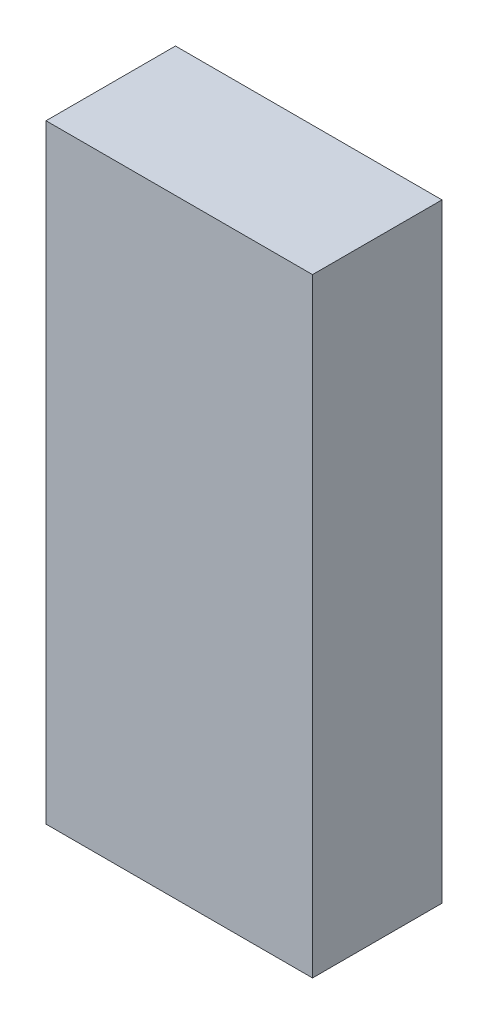
ISO-10303-21;
HEADER;
FILE_DESCRIPTION(('STEP AP214'),'2;1');
FILE_NAME('part.step','',(''),(''),'','','');
FILE_SCHEMA(('AUTOMOTIVE_DESIGN { 1 0 10303 214 1 1 1 1 }'));
ENDSEC;
DATA;
#1=APPLICATION_CONTEXT('core data for automotive mechanical design processes');
#2=APPLICATION_PROTOCOL_DEFINITION('international standard','automotive_design',2000,#1);
#3=PRODUCT_CONTEXT('',#1,'mechanical');
#4=PRODUCT('Part','Part','',(#3));
#5=PRODUCT_RELATED_PRODUCT_CATEGORY('part','',(#4));
#6=PRODUCT_DEFINITION_FORMATION('','',#4);
#7=PRODUCT_DEFINITION_CONTEXT('part definition',#1,'design');
#8=PRODUCT_DEFINITION('design','',#6,#7);
#9=PRODUCT_DEFINITION_SHAPE('','',#8);
#10=(LENGTH_UNIT() NAMED_UNIT(*) SI_UNIT(.MILLI.,.METRE.));
#11=(NAMED_UNIT(*) PLANE_ANGLE_UNIT() SI_UNIT($,.RADIAN.));
#12=(NAMED_UNIT(*) SI_UNIT($,.STERADIAN.) SOLID_ANGLE_UNIT());
#13=UNCERTAINTY_MEASURE_WITH_UNIT(LENGTH_MEASURE(1.E-05),#10,'distance_accuracy_value','');
#14=(GEOMETRIC_REPRESENTATION_CONTEXT(3) GLOBAL_UNCERTAINTY_ASSIGNED_CONTEXT((#13)) GLOBAL_UNIT_ASSIGNED_CONTEXT((#10,
#11,#12)) REPRESENTATION_CONTEXT('',''));
#15=CARTESIAN_POINT('',(0.,0.,0.));
#16=DIRECTION('',(0.,0.,1.));
#17=DIRECTION('',(1.,0.,0.));
#18=AXIS2_PLACEMENT_3D('',#15,#16,#17);
#19=CARTESIAN_POINT('',(-0.17499838,0.40000174,0.16999966));
#20=DIRECTION('',(0.,0.,1.));
#21=DIRECTION('',(1.,0.,0.));
#22=AXIS2_PLACEMENT_3D('',#19,#20,#21);
#23=PLANE('',#22);
#24=DIRECTION('',(0.,1.,0.));
#25=VECTOR('',#24,1.);
#26=CARTESIAN_POINT('',(0.17500092,0.40000174,0.16999966));
#27=LINE('',#26,#25);
#28=CARTESIAN_POINT('',(0.17500092,0.40000174,0.16999966));
#29=VERTEX_POINT('',#28);
#30=CARTESIAN_POINT('',(0.17500092,-0.3999992,0.16999966));
#31=VERTEX_POINT('',#30);
#32=EDGE_CURVE('E52',#29,#31,#27,.F.);
#33=ORIENTED_EDGE('',*,*,#32,.F.);
#34=DIRECTION('',(1.,0.,0.));
#35=VECTOR('',#34,1.);
#36=CARTESIAN_POINT('',(-0.17499838,0.40000174,0.16999966));
#37=LINE('',#36,#35);
#38=CARTESIAN_POINT('',(-0.17499838,0.40000174,0.16999966));
#39=VERTEX_POINT('',#38);
#40=EDGE_CURVE('E67',#39,#29,#37,.T.);
#41=ORIENTED_EDGE('',*,*,#40,.F.);
#42=DIRECTION('',(0.,1.,0.));
#43=VECTOR('',#42,1.);
#44=CARTESIAN_POINT('',(-0.17499838,-0.3999992,0.16999966));
#45=LINE('',#44,#43);
#46=CARTESIAN_POINT('',(-0.17499838,-0.3999992,0.16999966));
#47=VERTEX_POINT('',#46);
#48=EDGE_CURVE('E19',#47,#39,#45,.T.);
#49=ORIENTED_EDGE('',*,*,#48,.F.);
#50=DIRECTION('',(1.,0.,0.));
#51=VECTOR('',#50,1.);
#52=CARTESIAN_POINT('',(0.17500092,-0.3999992,0.16999966));
#53=LINE('',#52,#51);
#54=EDGE_CURVE('E57',#31,#47,#53,.F.);
#55=ORIENTED_EDGE('',*,*,#54,.F.);
#56=EDGE_LOOP('',(#33,#41,#49,#55));
#57=FACE_BOUND('',#56,.T.);
#58=ADVANCED_FACE('F16',(#57),#23,.T.);
#59=CARTESIAN_POINT('',(-0.17499838,-0.3999992,0.));
#60=DIRECTION('',(-1.,0.,0.));
#61=DIRECTION('',(0.,0.,1.));
#62=AXIS2_PLACEMENT_3D('',#59,#60,#61);
#63=PLANE('',#62);
#64=DIRECTION('',(0.,0.,1.));
#65=VECTOR('',#64,1.);
#66=CARTESIAN_POINT('',(-0.17499838,0.40000174,0.));
#67=LINE('',#66,#65);
#68=CARTESIAN_POINT('',(-0.17499838,0.40000174,0.));
#69=VERTEX_POINT('',#68);
#70=EDGE_CURVE('E78',#69,#39,#67,.T.);
#71=ORIENTED_EDGE('',*,*,#70,.F.);
#72=DIRECTION('',(0.,1.,0.));
#73=VECTOR('',#72,1.);
#74=CARTESIAN_POINT('',(-0.17499838,0.40000174,0.));
#75=LINE('',#74,#73);
#76=CARTESIAN_POINT('',(-0.17499838,-0.3999992,0.));
#77=VERTEX_POINT('',#76);
#78=EDGE_CURVE('E73',#69,#77,#75,.F.);
#79=ORIENTED_EDGE('',*,*,#78,.T.);
#80=DIRECTION('',(0.,0.,-1.));
#81=VECTOR('',#80,1.);
#82=CARTESIAN_POINT('',(-0.17499838,-0.3999992,0.));
#83=LINE('',#82,#81);
#84=EDGE_CURVE('E62',#47,#77,#83,.T.);
#85=ORIENTED_EDGE('',*,*,#84,.F.);
#86=ORIENTED_EDGE('',*,*,#48,.T.);
#87=EDGE_LOOP('',(#71,#79,#85,#86));
#88=FACE_BOUND('',#87,.T.);
#89=ADVANCED_FACE('F72',(#88),#63,.T.);
#90=CARTESIAN_POINT('',(0.17500092,-0.3999992,0.));
#91=DIRECTION('',(0.,-1.,0.));
#92=DIRECTION('',(0.,0.,-1.));
#93=AXIS2_PLACEMENT_3D('',#90,#91,#92);
#94=PLANE('',#93);
#95=ORIENTED_EDGE('',*,*,#84,.T.);
#96=DIRECTION('',(1.,0.,0.));
#97=VECTOR('',#96,1.);
#98=CARTESIAN_POINT('',(-0.17499838,-0.3999992,0.));
#99=LINE('',#98,#97);
#100=CARTESIAN_POINT('',(0.17500092,-0.3999992,0.));
#101=VERTEX_POINT('',#100);
#102=EDGE_CURVE('E83',#77,#101,#99,.T.);
#103=ORIENTED_EDGE('',*,*,#102,.T.);
#104=DIRECTION('',(0.,0.,-1.));
#105=VECTOR('',#104,1.);
#106=CARTESIAN_POINT('',(0.17500092,-0.3999992,0.));
#107=LINE('',#106,#105);
#108=EDGE_CURVE('E64',#31,#101,#107,.T.);
#109=ORIENTED_EDGE('',*,*,#108,.F.);
#110=ORIENTED_EDGE('',*,*,#54,.T.);
#111=EDGE_LOOP('',(#95,#103,#109,#110));
#112=FACE_BOUND('',#111,.T.);
#113=ADVANCED_FACE('F59',(#112),#94,.T.);
#114=CARTESIAN_POINT('',(0.17500092,0.40000174,0.));
#115=DIRECTION('',(1.,0.,0.));
#116=DIRECTION('',(0.,0.,-1.));
#117=AXIS2_PLACEMENT_3D('',#114,#115,#116);
#118=PLANE('',#117);
#119=ORIENTED_EDGE('',*,*,#108,.T.);
#120=DIRECTION('',(0.,1.,0.));
#121=VECTOR('',#120,1.);
#122=CARTESIAN_POINT('',(0.17500092,0.40000174,0.));
#123=LINE('',#122,#121);
#124=CARTESIAN_POINT('',(0.17500092,0.40000174,0.));
#125=VERTEX_POINT('',#124);
#126=EDGE_CURVE('E25',#101,#125,#123,.T.);
#127=ORIENTED_EDGE('',*,*,#126,.T.);
#128=DIRECTION('',(0.,0.,1.));
#129=VECTOR('',#128,1.);
#130=CARTESIAN_POINT('',(0.17500092,0.40000174,0.));
#131=LINE('',#130,#129);
#132=EDGE_CURVE('E33',#29,#125,#131,.F.);
#133=ORIENTED_EDGE('',*,*,#132,.F.);
#134=ORIENTED_EDGE('',*,*,#32,.T.);
#135=EDGE_LOOP('',(#119,#127,#133,#134));
#136=FACE_BOUND('',#135,.T.);
#137=ADVANCED_FACE('F87',(#136),#118,.T.);
#138=CARTESIAN_POINT('',(-0.17499838,0.40000174,0.));
#139=DIRECTION('',(0.,1.,0.));
#140=DIRECTION('',(0.,0.,1.));
#141=AXIS2_PLACEMENT_3D('',#138,#139,#140);
#142=PLANE('',#141);
#143=ORIENTED_EDGE('',*,*,#132,.T.);
#144=DIRECTION('',(1.,0.,0.));
#145=VECTOR('',#144,1.);
#146=CARTESIAN_POINT('',(-0.17499838,0.40000174,0.));
#147=LINE('',#146,#145);
#148=EDGE_CURVE('E11',#125,#69,#147,.F.);
#149=ORIENTED_EDGE('',*,*,#148,.T.);
#150=ORIENTED_EDGE('',*,*,#70,.T.);
#151=ORIENTED_EDGE('',*,*,#40,.T.);
#152=EDGE_LOOP('',(#143,#149,#150,#151));
#153=FACE_BOUND('',#152,.T.);
#154=ADVANCED_FACE('F90',(#153),#142,.T.);
#155=CARTESIAN_POINT('',(-0.17499838,0.40000174,0.));
#156=DIRECTION('',(0.,0.,1.));
#157=DIRECTION('',(1.,0.,0.));
#158=AXIS2_PLACEMENT_3D('',#155,#156,#157);
#159=PLANE('',#158);
#160=ORIENTED_EDGE('',*,*,#126,.F.);
#161=ORIENTED_EDGE('',*,*,#102,.F.);
#162=ORIENTED_EDGE('',*,*,#78,.F.);
#163=ORIENTED_EDGE('',*,*,#148,.F.);
#164=EDGE_LOOP('',(#160,#161,#162,#163));
#165=FACE_BOUND('',#164,.T.);
#166=ADVANCED_FACE('F89',(#165),#159,.F.);
#167=CLOSED_SHELL('',(#58,#89,#113,#137,#154,#166));
#168=MANIFOLD_SOLID_BREP('B1',#167);
#169=ADVANCED_BREP_SHAPE_REPRESENTATION('',(#18,#168),#14);
#170=SHAPE_DEFINITION_REPRESENTATION(#9,#169);
ENDSEC;
END-ISO-10303-21;
